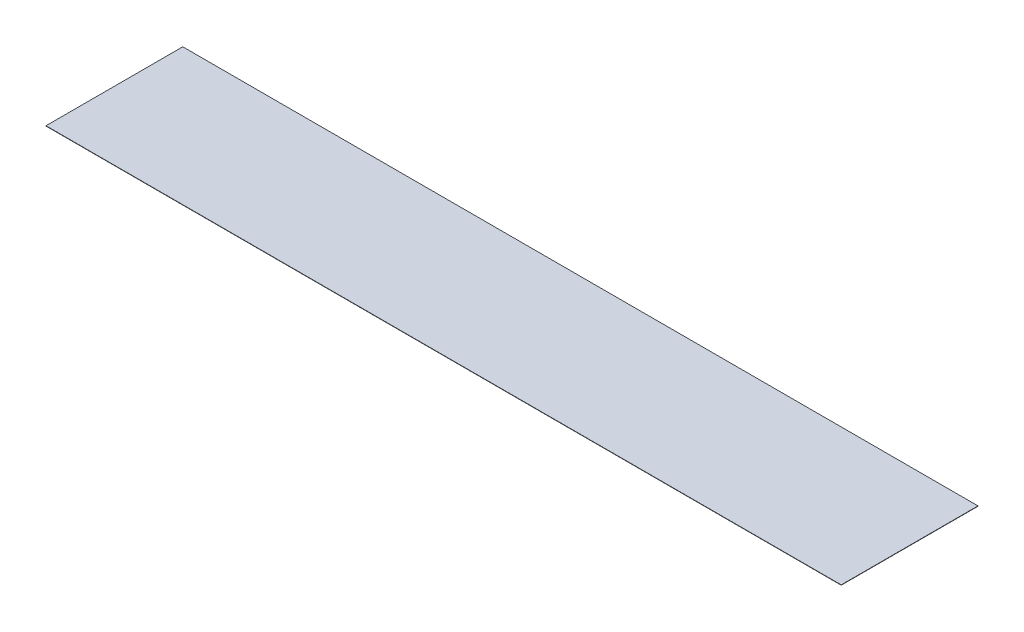
ISO-10303-21;
HEADER;
FILE_DESCRIPTION(('STEP AP214'),'2;1');
FILE_NAME('part.step','',(''),(''),'','','');
FILE_SCHEMA(('AUTOMOTIVE_DESIGN { 1 0 10303 214 1 1 1 1 }'));
ENDSEC;
DATA;
#1=APPLICATION_CONTEXT('core data for automotive mechanical design processes');
#2=APPLICATION_PROTOCOL_DEFINITION('international standard','automotive_design',2000,#1);
#3=PRODUCT_CONTEXT('',#1,'mechanical');
#4=PRODUCT('Part','Part','',(#3));
#5=PRODUCT_RELATED_PRODUCT_CATEGORY('part','',(#4));
#6=PRODUCT_DEFINITION_FORMATION('','',#4);
#7=PRODUCT_DEFINITION_CONTEXT('part definition',#1,'design');
#8=PRODUCT_DEFINITION('design','',#6,#7);
#9=PRODUCT_DEFINITION_SHAPE('','',#8);
#10=(LENGTH_UNIT() NAMED_UNIT(*) SI_UNIT(.MILLI.,.METRE.));
#11=(NAMED_UNIT(*) PLANE_ANGLE_UNIT() SI_UNIT($,.RADIAN.));
#12=(NAMED_UNIT(*) SI_UNIT($,.STERADIAN.) SOLID_ANGLE_UNIT());
#13=UNCERTAINTY_MEASURE_WITH_UNIT(LENGTH_MEASURE(1.E-05),#10,'distance_accuracy_value','');
#14=(GEOMETRIC_REPRESENTATION_CONTEXT(3) GLOBAL_UNCERTAINTY_ASSIGNED_CONTEXT((#13)) GLOBAL_UNIT_ASSIGNED_CONTEXT((#10,
#11,#12)) REPRESENTATION_CONTEXT('',''));
#15=CARTESIAN_POINT('',(0.,0.,0.));
#16=DIRECTION('',(0.,0.,1.));
#17=DIRECTION('',(1.,0.,0.));
#18=AXIS2_PLACEMENT_3D('',#15,#16,#17);
#19=CARTESIAN_POINT('',(250.,0.2,43.));
#20=DIRECTION('',(-1.,0.,0.));
#21=DIRECTION('',(0.,0.,1.));
#22=AXIS2_PLACEMENT_3D('',#19,#20,#21);
#23=PLANE('',#22);
#24=DIRECTION('',(0.,0.,-1.));
#25=VECTOR('',#24,1.);
#26=CARTESIAN_POINT('',(250.,0.,43.));
#27=LINE('',#26,#25);
#28=CARTESIAN_POINT('',(250.,0.,43.));
#29=VERTEX_POINT('',#28);
#30=CARTESIAN_POINT('',(250.,0.,-43.));
#31=VERTEX_POINT('',#30);
#32=EDGE_CURVE('E95',#29,#31,#27,.T.);
#33=ORIENTED_EDGE('',*,*,#32,.T.);
#34=DIRECTION('',(0.,-1.,0.));
#35=VECTOR('',#34,1.);
#36=CARTESIAN_POINT('',(250.,0.2,-43.));
#37=LINE('',#36,#35);
#38=CARTESIAN_POINT('',(250.,0.2,-43.));
#39=VERTEX_POINT('',#38);
#40=EDGE_CURVE('E11',#39,#31,#37,.T.);
#41=ORIENTED_EDGE('',*,*,#40,.F.);
#42=DIRECTION('',(0.,0.,-1.));
#43=VECTOR('',#42,1.);
#44=CARTESIAN_POINT('',(250.,0.2,43.));
#45=LINE('',#44,#43);
#46=CARTESIAN_POINT('',(250.,0.2,43.));
#47=VERTEX_POINT('',#46);
#48=EDGE_CURVE('E83',#47,#39,#45,.T.);
#49=ORIENTED_EDGE('',*,*,#48,.F.);
#50=DIRECTION('',(0.,-1.,0.));
#51=VECTOR('',#50,1.);
#52=CARTESIAN_POINT('',(250.,0.2,43.));
#53=LINE('',#52,#51);
#54=EDGE_CURVE('E91',#47,#29,#53,.T.);
#55=ORIENTED_EDGE('',*,*,#54,.T.);
#56=EDGE_LOOP('',(#33,#41,#49,#55));
#57=FACE_BOUND('',#56,.T.);
#58=ADVANCED_FACE('F32',(#57),#23,.F.);
#59=CARTESIAN_POINT('',(-250.,0.2,-43.));
#60=DIRECTION('',(0.,0.,1.));
#61=DIRECTION('',(1.,0.,0.));
#62=AXIS2_PLACEMENT_3D('',#59,#60,#61);
#63=PLANE('',#62);
#64=DIRECTION('',(-1.,0.,0.));
#65=VECTOR('',#64,1.);
#66=CARTESIAN_POINT('',(-250.,0.,-43.));
#67=LINE('',#66,#65);
#68=CARTESIAN_POINT('',(-250.,0.,-43.));
#69=VERTEX_POINT('',#68);
#70=EDGE_CURVE('E87',#31,#69,#67,.T.);
#71=ORIENTED_EDGE('',*,*,#70,.T.);
#72=DIRECTION('',(0.,-1.,0.));
#73=VECTOR('',#72,1.);
#74=CARTESIAN_POINT('',(-250.,0.2,-43.));
#75=LINE('',#74,#73);
#76=CARTESIAN_POINT('',(-250.,0.2,-43.));
#77=VERTEX_POINT('',#76);
#78=EDGE_CURVE('E40',#77,#69,#75,.T.);
#79=ORIENTED_EDGE('',*,*,#78,.F.);
#80=DIRECTION('',(-1.,0.,0.));
#81=VECTOR('',#80,1.);
#82=CARTESIAN_POINT('',(-250.,0.2,-43.));
#83=LINE('',#82,#81);
#84=EDGE_CURVE('E78',#39,#77,#83,.T.);
#85=ORIENTED_EDGE('',*,*,#84,.F.);
#86=ORIENTED_EDGE('',*,*,#40,.T.);
#87=EDGE_LOOP('',(#71,#79,#85,#86));
#88=FACE_BOUND('',#87,.T.);
#89=ADVANCED_FACE('F86',(#88),#63,.F.);
#90=CARTESIAN_POINT('',(-250.,0.2,43.));
#91=DIRECTION('',(1.,0.,0.));
#92=DIRECTION('',(0.,0.,-1.));
#93=AXIS2_PLACEMENT_3D('',#90,#91,#92);
#94=PLANE('',#93);
#95=DIRECTION('',(0.,0.,1.));
#96=VECTOR('',#95,1.);
#97=CARTESIAN_POINT('',(-250.,0.,43.));
#98=LINE('',#97,#96);
#99=CARTESIAN_POINT('',(-250.,0.,43.));
#100=VERTEX_POINT('',#99);
#101=EDGE_CURVE('E65',#69,#100,#98,.T.);
#102=ORIENTED_EDGE('',*,*,#101,.T.);
#103=DIRECTION('',(0.,-1.,0.));
#104=VECTOR('',#103,1.);
#105=CARTESIAN_POINT('',(-250.,0.2,43.));
#106=LINE('',#105,#104);
#107=CARTESIAN_POINT('',(-250.,0.2,43.));
#108=VERTEX_POINT('',#107);
#109=EDGE_CURVE('E88',#108,#100,#106,.T.);
#110=ORIENTED_EDGE('',*,*,#109,.F.);
#111=DIRECTION('',(0.,0.,1.));
#112=VECTOR('',#111,1.);
#113=CARTESIAN_POINT('',(-250.,0.2,43.));
#114=LINE('',#113,#112);
#115=EDGE_CURVE('E81',#77,#108,#114,.T.);
#116=ORIENTED_EDGE('',*,*,#115,.F.);
#117=ORIENTED_EDGE('',*,*,#78,.T.);
#118=EDGE_LOOP('',(#102,#110,#116,#117));
#119=FACE_BOUND('',#118,.T.);
#120=ADVANCED_FACE('F89',(#119),#94,.F.);
#121=CARTESIAN_POINT('',(-250.,0.2,43.));
#122=DIRECTION('',(0.,0.,-1.));
#123=DIRECTION('',(-1.,0.,0.));
#124=AXIS2_PLACEMENT_3D('',#121,#122,#123);
#125=PLANE('',#124);
#126=DIRECTION('',(1.,0.,0.));
#127=VECTOR('',#126,1.);
#128=CARTESIAN_POINT('',(-250.,0.,43.));
#129=LINE('',#128,#127);
#130=EDGE_CURVE('E71',#100,#29,#129,.T.);
#131=ORIENTED_EDGE('',*,*,#130,.T.);
#132=ORIENTED_EDGE('',*,*,#54,.F.);
#133=DIRECTION('',(1.,0.,0.));
#134=VECTOR('',#133,1.);
#135=CARTESIAN_POINT('',(-250.,0.2,43.));
#136=LINE('',#135,#134);
#137=EDGE_CURVE('E48',#108,#47,#136,.T.);
#138=ORIENTED_EDGE('',*,*,#137,.F.);
#139=ORIENTED_EDGE('',*,*,#109,.T.);
#140=EDGE_LOOP('',(#131,#132,#138,#139));
#141=FACE_BOUND('',#140,.T.);
#142=ADVANCED_FACE('F102',(#141),#125,.F.);
#143=CARTESIAN_POINT('',(0.,0.2,0.));
#144=DIRECTION('',(0.,-1.,0.));
#145=DIRECTION('',(0.,0.,-1.));
#146=AXIS2_PLACEMENT_3D('',#143,#144,#145);
#147=PLANE('',#146);
#148=ORIENTED_EDGE('',*,*,#48,.T.);
#149=ORIENTED_EDGE('',*,*,#84,.T.);
#150=ORIENTED_EDGE('',*,*,#115,.T.);
#151=ORIENTED_EDGE('',*,*,#137,.T.);
#152=EDGE_LOOP('',(#148,#149,#150,#151));
#153=FACE_BOUND('',#152,.T.);
#154=ADVANCED_FACE('F79',(#153),#147,.F.);
#155=CARTESIAN_POINT('',(0.,0.,0.));
#156=DIRECTION('',(0.,-1.,0.));
#157=DIRECTION('',(0.,0.,-1.));
#158=AXIS2_PLACEMENT_3D('',#155,#156,#157);
#159=PLANE('',#158);
#160=ORIENTED_EDGE('',*,*,#32,.F.);
#161=ORIENTED_EDGE('',*,*,#130,.F.);
#162=ORIENTED_EDGE('',*,*,#101,.F.);
#163=ORIENTED_EDGE('',*,*,#70,.F.);
#164=EDGE_LOOP('',(#160,#161,#162,#163));
#165=FACE_BOUND('',#164,.T.);
#166=ADVANCED_FACE('F105',(#165),#159,.T.);
#167=CLOSED_SHELL('',(#58,#89,#120,#142,#154,#166));
#168=MANIFOLD_SOLID_BREP('B2',#167);
#169=ADVANCED_BREP_SHAPE_REPRESENTATION('',(#18,#168),#14);
#170=SHAPE_DEFINITION_REPRESENTATION(#9,#169);
ENDSEC;
END-ISO-10303-21;
